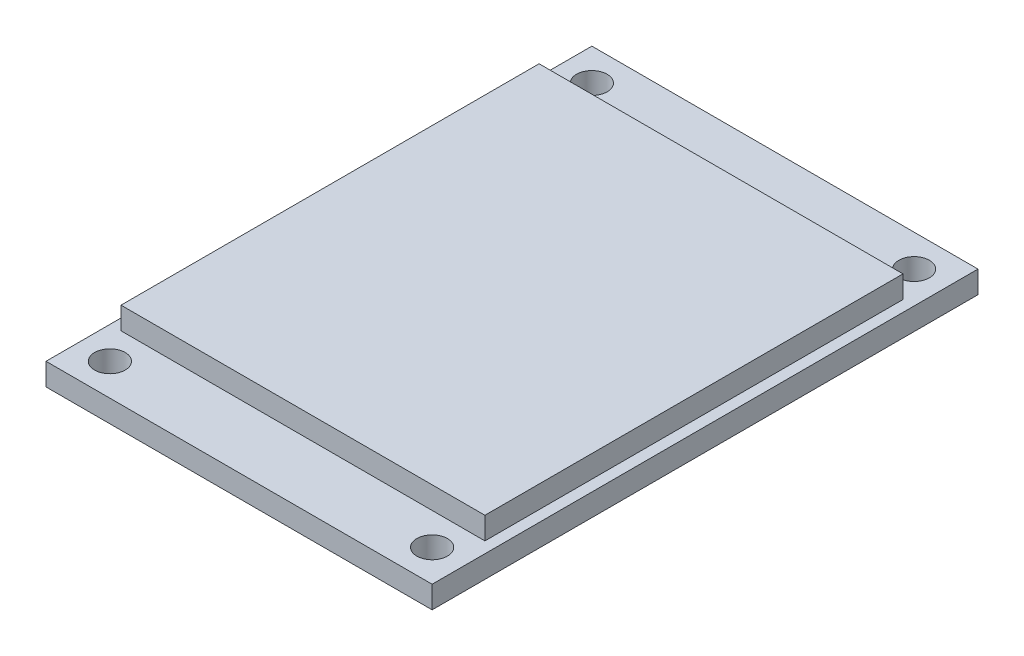
ISO-10303-21;
HEADER;
FILE_DESCRIPTION(('STEP AP214'),'2;1');
FILE_NAME('part.step','',(''),(''),'','','');
FILE_SCHEMA(('AUTOMOTIVE_DESIGN { 1 0 10303 214 1 1 1 1 }'));
ENDSEC;
DATA;
#1=APPLICATION_CONTEXT('core data for automotive mechanical design processes');
#2=APPLICATION_PROTOCOL_DEFINITION('international standard','automotive_design',2000,#1);
#3=PRODUCT_CONTEXT('',#1,'mechanical');
#4=PRODUCT('Part','Part','',(#3));
#5=PRODUCT_RELATED_PRODUCT_CATEGORY('part','',(#4));
#6=PRODUCT_DEFINITION_FORMATION('','',#4);
#7=PRODUCT_DEFINITION_CONTEXT('part definition',#1,'design');
#8=PRODUCT_DEFINITION('design','',#6,#7);
#9=PRODUCT_DEFINITION_SHAPE('','',#8);
#10=(LENGTH_UNIT() NAMED_UNIT(*) SI_UNIT(.MILLI.,.METRE.));
#11=(NAMED_UNIT(*) PLANE_ANGLE_UNIT() SI_UNIT($,.RADIAN.));
#12=(NAMED_UNIT(*) SI_UNIT($,.STERADIAN.) SOLID_ANGLE_UNIT());
#13=UNCERTAINTY_MEASURE_WITH_UNIT(LENGTH_MEASURE(1.E-05),#10,'distance_accuracy_value','');
#14=(GEOMETRIC_REPRESENTATION_CONTEXT(3) GLOBAL_UNCERTAINTY_ASSIGNED_CONTEXT((#13)) GLOBAL_UNIT_ASSIGNED_CONTEXT((#10,
#11,#12)) REPRESENTATION_CONTEXT('',''));
#15=CARTESIAN_POINT('',(0.,0.,0.));
#16=DIRECTION('',(0.,0.,1.));
#17=DIRECTION('',(1.,0.,0.));
#18=AXIS2_PLACEMENT_3D('',#15,#16,#17);
#19=CARTESIAN_POINT('',(0.,0.,0.));
#20=DIRECTION('',(0.,1.,0.));
#21=DIRECTION('',(0.,0.,1.));
#22=AXIS2_PLACEMENT_3D('',#19,#20,#21);
#23=PLANE('',#22);
#24=DIRECTION('',(0.,0.,1.));
#25=VECTOR('',#24,1.);
#26=CARTESIAN_POINT('',(-13.9,0.,19.65));
#27=LINE('',#26,#25);
#28=CARTESIAN_POINT('',(-13.9,0.,-19.65));
#29=VERTEX_POINT('',#28);
#30=CARTESIAN_POINT('',(-13.9,0.,19.65));
#31=VERTEX_POINT('',#30);
#32=EDGE_CURVE('E213',#29,#31,#27,.T.);
#33=ORIENTED_EDGE('',*,*,#32,.F.);
#34=DIRECTION('',(-1.,0.,0.));
#35=VECTOR('',#34,1.);
#36=CARTESIAN_POINT('',(13.9,0.,-19.65));
#37=LINE('',#36,#35);
#38=CARTESIAN_POINT('',(13.9,0.,-19.65));
#39=VERTEX_POINT('',#38);
#40=EDGE_CURVE('E220',#39,#29,#37,.T.);
#41=ORIENTED_EDGE('',*,*,#40,.F.);
#42=DIRECTION('',(0.,0.,-1.));
#43=VECTOR('',#42,1.);
#44=CARTESIAN_POINT('',(13.9,0.,19.65));
#45=LINE('',#44,#43);
#46=CARTESIAN_POINT('',(13.9,0.,19.65));
#47=VERTEX_POINT('',#46);
#48=EDGE_CURVE('E231',#47,#39,#45,.T.);
#49=ORIENTED_EDGE('',*,*,#48,.F.);
#50=DIRECTION('',(1.,0.,0.));
#51=VECTOR('',#50,1.);
#52=CARTESIAN_POINT('',(13.9,0.,19.65));
#53=LINE('',#52,#51);
#54=EDGE_CURVE('E229',#31,#47,#53,.T.);
#55=ORIENTED_EDGE('',*,*,#54,.F.);
#56=EDGE_LOOP('',(#33,#41,#49,#55));
#57=FACE_BOUND('',#56,.T.);
#58=CARTESIAN_POINT('',(-11.6,0.,-17.35));
#59=DIRECTION('',(0.,1.,0.));
#60=DIRECTION('',(0.,0.,1.));
#61=AXIS2_PLACEMENT_3D('',#58,#59,#60);
#62=CIRCLE('',#61,1.1);
#63=CARTESIAN_POINT('',(-11.6,0.,-16.25));
#64=VERTEX_POINT('',#63);
#65=EDGE_CURVE('E210',#64,#64,#62,.T.);
#66=ORIENTED_EDGE('',*,*,#65,.T.);
#67=EDGE_LOOP('',(#66));
#68=FACE_BOUND('',#67,.T.);
#69=CARTESIAN_POINT('',(11.6,0.,17.35));
#70=DIRECTION('',(0.,1.,0.));
#71=DIRECTION('',(0.,0.,1.));
#72=AXIS2_PLACEMENT_3D('',#69,#70,#71);
#73=CIRCLE('',#72,1.1);
#74=CARTESIAN_POINT('',(11.6,0.,18.45));
#75=VERTEX_POINT('',#74);
#76=EDGE_CURVE('E191',#75,#75,#73,.T.);
#77=ORIENTED_EDGE('',*,*,#76,.T.);
#78=EDGE_LOOP('',(#77));
#79=FACE_BOUND('',#78,.T.);
#80=CARTESIAN_POINT('',(-11.6,0.,17.35));
#81=DIRECTION('',(0.,1.,0.));
#82=DIRECTION('',(0.,0.,-1.));
#83=AXIS2_PLACEMENT_3D('',#80,#81,#82);
#84=CIRCLE('',#83,1.1);
#85=CARTESIAN_POINT('',(-11.6,0.,16.25));
#86=VERTEX_POINT('',#85);
#87=EDGE_CURVE('E195',#86,#86,#84,.T.);
#88=ORIENTED_EDGE('',*,*,#87,.T.);
#89=EDGE_LOOP('',(#88));
#90=FACE_BOUND('',#89,.T.);
#91=CARTESIAN_POINT('',(11.6,0.,-17.35));
#92=DIRECTION('',(0.,1.,0.));
#93=DIRECTION('',(0.,0.,-1.));
#94=AXIS2_PLACEMENT_3D('',#91,#92,#93);
#95=CIRCLE('',#94,1.1);
#96=CARTESIAN_POINT('',(11.6,0.,-18.45));
#97=VERTEX_POINT('',#96);
#98=EDGE_CURVE('E202',#97,#97,#95,.T.);
#99=ORIENTED_EDGE('',*,*,#98,.T.);
#100=EDGE_LOOP('',(#99));
#101=FACE_BOUND('',#100,.T.);
#102=DIRECTION('',(0.,0.,-1.));
#103=VECTOR('',#102,1.);
#104=CARTESIAN_POINT('',(-8.89,0.,-18.95));
#105=LINE('',#104,#103);
#106=CARTESIAN_POINT('',(-8.89,0.,-16.41));
#107=VERTEX_POINT('',#106);
#108=CARTESIAN_POINT('',(-8.89,0.,-18.95));
#109=VERTEX_POINT('',#108);
#110=EDGE_CURVE('E156',#107,#109,#105,.T.);
#111=ORIENTED_EDGE('',*,*,#110,.F.);
#112=DIRECTION('',(-1.,0.,0.));
#113=VECTOR('',#112,1.);
#114=CARTESIAN_POINT('',(8.89,0.,-16.41));
#115=LINE('',#114,#113);
#116=CARTESIAN_POINT('',(8.89,0.,-16.41));
#117=VERTEX_POINT('',#116);
#118=EDGE_CURVE('E153',#117,#107,#115,.T.);
#119=ORIENTED_EDGE('',*,*,#118,.F.);
#120=DIRECTION('',(0.,0.,1.));
#121=VECTOR('',#120,1.);
#122=CARTESIAN_POINT('',(8.89,0.,-18.95));
#123=LINE('',#122,#121);
#124=CARTESIAN_POINT('',(8.89,0.,-18.95));
#125=VERTEX_POINT('',#124);
#126=EDGE_CURVE('E67',#125,#117,#123,.T.);
#127=ORIENTED_EDGE('',*,*,#126,.F.);
#128=DIRECTION('',(1.,0.,0.));
#129=VECTOR('',#128,1.);
#130=CARTESIAN_POINT('',(8.89,0.,-18.95));
#131=LINE('',#130,#129);
#132=EDGE_CURVE('E62',#109,#125,#131,.T.);
#133=ORIENTED_EDGE('',*,*,#132,.F.);
#134=EDGE_LOOP('',(#111,#119,#127,#133));
#135=FACE_BOUND('',#134,.T.);
#136=ADVANCED_FACE('F47',(#57,#68,#79,#90,#101,#135),#23,.F.);
#137=CARTESIAN_POINT('',(0.,1.6,0.));
#138=DIRECTION('',(0.,1.,0.));
#139=DIRECTION('',(0.,0.,1.));
#140=AXIS2_PLACEMENT_3D('',#137,#138,#139);
#141=PLANE('',#140);
#142=CARTESIAN_POINT('',(11.6,1.6,-17.35));
#143=DIRECTION('',(0.,1.,0.));
#144=DIRECTION('',(0.,0.,-1.));
#145=AXIS2_PLACEMENT_3D('',#142,#143,#144);
#146=CIRCLE('',#145,1.1);
#147=CARTESIAN_POINT('',(11.6,1.6,-18.45));
#148=VERTEX_POINT('',#147);
#149=EDGE_CURVE('E198',#148,#148,#146,.T.);
#150=ORIENTED_EDGE('',*,*,#149,.F.);
#151=EDGE_LOOP('',(#150));
#152=FACE_BOUND('',#151,.T.);
#153=CARTESIAN_POINT('',(-11.6,1.6,17.35));
#154=DIRECTION('',(0.,1.,0.));
#155=DIRECTION('',(0.,0.,-1.));
#156=AXIS2_PLACEMENT_3D('',#153,#154,#155);
#157=CIRCLE('',#156,1.1);
#158=CARTESIAN_POINT('',(-11.6,1.6,16.25));
#159=VERTEX_POINT('',#158);
#160=EDGE_CURVE('E205',#159,#159,#157,.T.);
#161=ORIENTED_EDGE('',*,*,#160,.F.);
#162=EDGE_LOOP('',(#161));
#163=FACE_BOUND('',#162,.T.);
#164=CARTESIAN_POINT('',(11.6,1.6,17.35));
#165=DIRECTION('',(0.,1.,0.));
#166=DIRECTION('',(0.,0.,1.));
#167=AXIS2_PLACEMENT_3D('',#164,#165,#166);
#168=CIRCLE('',#167,1.1);
#169=CARTESIAN_POINT('',(11.6,1.6,18.45));
#170=VERTEX_POINT('',#169);
#171=EDGE_CURVE('E192',#170,#170,#168,.T.);
#172=ORIENTED_EDGE('',*,*,#171,.F.);
#173=EDGE_LOOP('',(#172));
#174=FACE_BOUND('',#173,.T.);
#175=CARTESIAN_POINT('',(-11.6,1.6,-17.35));
#176=DIRECTION('',(0.,1.,0.));
#177=DIRECTION('',(0.,0.,1.));
#178=AXIS2_PLACEMENT_3D('',#175,#176,#177);
#179=CIRCLE('',#178,1.1);
#180=CARTESIAN_POINT('',(-11.6,1.6,-16.25));
#181=VERTEX_POINT('',#180);
#182=EDGE_CURVE('E201',#181,#181,#179,.T.);
#183=ORIENTED_EDGE('',*,*,#182,.F.);
#184=EDGE_LOOP('',(#183));
#185=FACE_BOUND('',#184,.T.);
#186=DIRECTION('',(0.,0.,1.));
#187=VECTOR('',#186,1.);
#188=CARTESIAN_POINT('',(-13.9,1.6,19.65));
#189=LINE('',#188,#187);
#190=CARTESIAN_POINT('',(-13.9,1.6,-19.65));
#191=VERTEX_POINT('',#190);
#192=CARTESIAN_POINT('',(-13.9,1.6,19.65));
#193=VERTEX_POINT('',#192);
#194=EDGE_CURVE('E216',#191,#193,#189,.T.);
#195=ORIENTED_EDGE('',*,*,#194,.T.);
#196=DIRECTION('',(1.,0.,0.));
#197=VECTOR('',#196,1.);
#198=CARTESIAN_POINT('',(13.9,1.6,19.65));
#199=LINE('',#198,#197);
#200=CARTESIAN_POINT('',(13.9,1.6,19.65));
#201=VERTEX_POINT('',#200);
#202=EDGE_CURVE('E219',#193,#201,#199,.T.);
#203=ORIENTED_EDGE('',*,*,#202,.T.);
#204=DIRECTION('',(0.,0.,-1.));
#205=VECTOR('',#204,1.);
#206=CARTESIAN_POINT('',(13.9,1.6,19.65));
#207=LINE('',#206,#205);
#208=CARTESIAN_POINT('',(13.9,1.6,-19.65));
#209=VERTEX_POINT('',#208);
#210=EDGE_CURVE('E222',#201,#209,#207,.T.);
#211=ORIENTED_EDGE('',*,*,#210,.T.);
#212=DIRECTION('',(-1.,0.,0.));
#213=VECTOR('',#212,1.);
#214=CARTESIAN_POINT('',(13.9,1.6,-19.65));
#215=LINE('',#214,#213);
#216=EDGE_CURVE('E224',#209,#191,#215,.T.);
#217=ORIENTED_EDGE('',*,*,#216,.T.);
#218=EDGE_LOOP('',(#195,#203,#211,#217));
#219=FACE_BOUND('',#218,.T.);
#220=DIRECTION('',(-1.,0.,0.));
#221=VECTOR('',#220,1.);
#222=CARTESIAN_POINT('',(-13.1,1.6,-15.05));
#223=LINE('',#222,#221);
#224=CARTESIAN_POINT('',(13.1,1.6,-15.05));
#225=VERTEX_POINT('',#224);
#226=CARTESIAN_POINT('',(-13.1,1.6,-15.05));
#227=VERTEX_POINT('',#226);
#228=EDGE_CURVE('E160',#225,#227,#223,.T.);
#229=ORIENTED_EDGE('',*,*,#228,.F.);
#230=DIRECTION('',(0.,0.,-1.));
#231=VECTOR('',#230,1.);
#232=CARTESIAN_POINT('',(13.1,1.6,15.05));
#233=LINE('',#232,#231);
#234=CARTESIAN_POINT('',(13.1,1.6,15.05));
#235=VERTEX_POINT('',#234);
#236=EDGE_CURVE('E157',#235,#225,#233,.T.);
#237=ORIENTED_EDGE('',*,*,#236,.F.);
#238=DIRECTION('',(1.,0.,0.));
#239=VECTOR('',#238,1.);
#240=CARTESIAN_POINT('',(-13.1,1.6,15.05));
#241=LINE('',#240,#239);
#242=CARTESIAN_POINT('',(-13.1,1.6,15.05));
#243=VERTEX_POINT('',#242);
#244=EDGE_CURVE('E170',#243,#235,#241,.T.);
#245=ORIENTED_EDGE('',*,*,#244,.F.);
#246=DIRECTION('',(0.,0.,1.));
#247=VECTOR('',#246,1.);
#248=CARTESIAN_POINT('',(-13.1,1.6,15.05));
#249=LINE('',#248,#247);
#250=EDGE_CURVE('E178',#227,#243,#249,.T.);
#251=ORIENTED_EDGE('',*,*,#250,.F.);
#252=EDGE_LOOP('',(#229,#237,#245,#251));
#253=FACE_BOUND('',#252,.T.);
#254=ADVANCED_FACE('F258',(#152,#163,#174,#185,#219,#253),#141,.T.);
#255=CARTESIAN_POINT('',(-13.9,1.6,19.65));
#256=DIRECTION('',(1.,0.,0.));
#257=DIRECTION('',(0.,0.,-1.));
#258=AXIS2_PLACEMENT_3D('',#255,#256,#257);
#259=PLANE('',#258);
#260=ORIENTED_EDGE('',*,*,#32,.T.);
#261=DIRECTION('',(0.,-1.,0.));
#262=VECTOR('',#261,1.);
#263=CARTESIAN_POINT('',(-13.9,1.6,19.65));
#264=LINE('',#263,#262);
#265=EDGE_CURVE('E11',#193,#31,#264,.T.);
#266=ORIENTED_EDGE('',*,*,#265,.F.);
#267=ORIENTED_EDGE('',*,*,#194,.F.);
#268=DIRECTION('',(0.,-1.,0.));
#269=VECTOR('',#268,1.);
#270=CARTESIAN_POINT('',(-13.9,1.6,-19.65));
#271=LINE('',#270,#269);
#272=EDGE_CURVE('E226',#191,#29,#271,.T.);
#273=ORIENTED_EDGE('',*,*,#272,.T.);
#274=EDGE_LOOP('',(#260,#266,#267,#273));
#275=FACE_BOUND('',#274,.T.);
#276=ADVANCED_FACE('F49',(#275),#259,.F.);
#277=CARTESIAN_POINT('',(13.9,1.6,19.65));
#278=DIRECTION('',(0.,0.,-1.));
#279=DIRECTION('',(-1.,0.,0.));
#280=AXIS2_PLACEMENT_3D('',#277,#278,#279);
#281=PLANE('',#280);
#282=ORIENTED_EDGE('',*,*,#54,.T.);
#283=DIRECTION('',(0.,-1.,0.));
#284=VECTOR('',#283,1.);
#285=CARTESIAN_POINT('',(13.9,1.6,19.65));
#286=LINE('',#285,#284);
#287=EDGE_CURVE('E55',#201,#47,#286,.T.);
#288=ORIENTED_EDGE('',*,*,#287,.F.);
#289=ORIENTED_EDGE('',*,*,#202,.F.);
#290=ORIENTED_EDGE('',*,*,#265,.T.);
#291=EDGE_LOOP('',(#282,#288,#289,#290));
#292=FACE_BOUND('',#291,.T.);
#293=ADVANCED_FACE('F260',(#292),#281,.F.);
#294=CARTESIAN_POINT('',(13.9,1.6,19.65));
#295=DIRECTION('',(-1.,0.,0.));
#296=DIRECTION('',(0.,0.,1.));
#297=AXIS2_PLACEMENT_3D('',#294,#295,#296);
#298=PLANE('',#297);
#299=ORIENTED_EDGE('',*,*,#48,.T.);
#300=DIRECTION('',(0.,-1.,0.));
#301=VECTOR('',#300,1.);
#302=CARTESIAN_POINT('',(13.9,1.6,-19.65));
#303=LINE('',#302,#301);
#304=EDGE_CURVE('E236',#209,#39,#303,.T.);
#305=ORIENTED_EDGE('',*,*,#304,.F.);
#306=ORIENTED_EDGE('',*,*,#210,.F.);
#307=ORIENTED_EDGE('',*,*,#287,.T.);
#308=EDGE_LOOP('',(#299,#305,#306,#307));
#309=FACE_BOUND('',#308,.T.);
#310=ADVANCED_FACE('F243',(#309),#298,.F.);
#311=CARTESIAN_POINT('',(13.9,1.6,-19.65));
#312=DIRECTION('',(0.,0.,1.));
#313=DIRECTION('',(1.,0.,0.));
#314=AXIS2_PLACEMENT_3D('',#311,#312,#313);
#315=PLANE('',#314);
#316=ORIENTED_EDGE('',*,*,#40,.T.);
#317=ORIENTED_EDGE('',*,*,#272,.F.);
#318=ORIENTED_EDGE('',*,*,#216,.F.);
#319=ORIENTED_EDGE('',*,*,#304,.T.);
#320=EDGE_LOOP('',(#316,#317,#318,#319));
#321=FACE_BOUND('',#320,.T.);
#322=ADVANCED_FACE('F252',(#321),#315,.F.);
#323=CARTESIAN_POINT('',(-11.6,0.,-17.35));
#324=DIRECTION('',(0.,1.,0.));
#325=DIRECTION('',(0.,0.,1.));
#326=AXIS2_PLACEMENT_3D('',#323,#324,#325);
#327=CYLINDRICAL_SURFACE('',#326,1.1);
#328=ORIENTED_EDGE('',*,*,#65,.F.);
#329=EDGE_LOOP('',(#328));
#330=FACE_BOUND('',#329,.T.);
#331=ORIENTED_EDGE('',*,*,#182,.T.);
#332=EDGE_LOOP('',(#331));
#333=FACE_BOUND('',#332,.T.);
#334=ADVANCED_FACE('F279',(#330,#333),#327,.F.);
#335=CARTESIAN_POINT('',(11.6,0.,17.35));
#336=DIRECTION('',(0.,1.,0.));
#337=DIRECTION('',(0.,0.,1.));
#338=AXIS2_PLACEMENT_3D('',#335,#336,#337);
#339=CYLINDRICAL_SURFACE('',#338,1.1);
#340=ORIENTED_EDGE('',*,*,#76,.F.);
#341=EDGE_LOOP('',(#340));
#342=FACE_BOUND('',#341,.T.);
#343=ORIENTED_EDGE('',*,*,#171,.T.);
#344=EDGE_LOOP('',(#343));
#345=FACE_BOUND('',#344,.T.);
#346=ADVANCED_FACE('F283',(#342,#345),#339,.F.);
#347=CARTESIAN_POINT('',(-11.6,0.,17.35));
#348=DIRECTION('',(0.,1.,0.));
#349=DIRECTION('',(0.,0.,1.));
#350=AXIS2_PLACEMENT_3D('',#347,#348,#349);
#351=CYLINDRICAL_SURFACE('',#350,1.1);
#352=ORIENTED_EDGE('',*,*,#87,.F.);
#353=EDGE_LOOP('',(#352));
#354=FACE_BOUND('',#353,.T.);
#355=ORIENTED_EDGE('',*,*,#160,.T.);
#356=EDGE_LOOP('',(#355));
#357=FACE_BOUND('',#356,.T.);
#358=ADVANCED_FACE('F288',(#354,#357),#351,.F.);
#359=CARTESIAN_POINT('',(11.6,0.,-17.35));
#360=DIRECTION('',(0.,1.,0.));
#361=DIRECTION('',(0.,0.,1.));
#362=AXIS2_PLACEMENT_3D('',#359,#360,#361);
#363=CYLINDRICAL_SURFACE('',#362,1.1);
#364=ORIENTED_EDGE('',*,*,#98,.F.);
#365=EDGE_LOOP('',(#364));
#366=FACE_BOUND('',#365,.T.);
#367=ORIENTED_EDGE('',*,*,#149,.T.);
#368=EDGE_LOOP('',(#367));
#369=FACE_BOUND('',#368,.T.);
#370=ADVANCED_FACE('F296',(#366,#369),#363,.F.);
#371=CARTESIAN_POINT('',(13.1,3.2,15.05));
#372=DIRECTION('',(-1.,0.,0.));
#373=DIRECTION('',(0.,0.,1.));
#374=AXIS2_PLACEMENT_3D('',#371,#372,#373);
#375=PLANE('',#374);
#376=ORIENTED_EDGE('',*,*,#236,.T.);
#377=DIRECTION('',(0.,-1.,0.));
#378=VECTOR('',#377,1.);
#379=CARTESIAN_POINT('',(13.1,3.2,-15.05));
#380=LINE('',#379,#378);
#381=CARTESIAN_POINT('',(13.1,3.2,-15.05));
#382=VERTEX_POINT('',#381);
#383=EDGE_CURVE('E189',#382,#225,#380,.T.);
#384=ORIENTED_EDGE('',*,*,#383,.F.);
#385=DIRECTION('',(0.,0.,-1.));
#386=VECTOR('',#385,1.);
#387=CARTESIAN_POINT('',(13.1,3.2,15.05));
#388=LINE('',#387,#386);
#389=CARTESIAN_POINT('',(13.1,3.2,15.05));
#390=VERTEX_POINT('',#389);
#391=EDGE_CURVE('E166',#390,#382,#388,.T.);
#392=ORIENTED_EDGE('',*,*,#391,.F.);
#393=DIRECTION('',(0.,-1.,0.));
#394=VECTOR('',#393,1.);
#395=CARTESIAN_POINT('',(13.1,3.2,15.05));
#396=LINE('',#395,#394);
#397=EDGE_CURVE('E175',#390,#235,#396,.T.);
#398=ORIENTED_EDGE('',*,*,#397,.T.);
#399=EDGE_LOOP('',(#376,#384,#392,#398));
#400=FACE_BOUND('',#399,.T.);
#401=ADVANCED_FACE('F299',(#400),#375,.F.);
#402=CARTESIAN_POINT('',(-13.1,3.2,-15.05));
#403=DIRECTION('',(0.,0.,1.));
#404=DIRECTION('',(1.,0.,0.));
#405=AXIS2_PLACEMENT_3D('',#402,#403,#404);
#406=PLANE('',#405);
#407=ORIENTED_EDGE('',*,*,#228,.T.);
#408=DIRECTION('',(0.,-1.,0.));
#409=VECTOR('',#408,1.);
#410=CARTESIAN_POINT('',(-13.1,3.2,-15.05));
#411=LINE('',#410,#409);
#412=CARTESIAN_POINT('',(-13.1,3.2,-15.05));
#413=VERTEX_POINT('',#412);
#414=EDGE_CURVE('E186',#413,#227,#411,.T.);
#415=ORIENTED_EDGE('',*,*,#414,.F.);
#416=DIRECTION('',(-1.,0.,0.));
#417=VECTOR('',#416,1.);
#418=CARTESIAN_POINT('',(-13.1,3.2,-15.05));
#419=LINE('',#418,#417);
#420=EDGE_CURVE('E169',#382,#413,#419,.T.);
#421=ORIENTED_EDGE('',*,*,#420,.F.);
#422=ORIENTED_EDGE('',*,*,#383,.T.);
#423=EDGE_LOOP('',(#407,#415,#421,#422));
#424=FACE_BOUND('',#423,.T.);
#425=ADVANCED_FACE('F304',(#424),#406,.F.);
#426=CARTESIAN_POINT('',(-13.1,3.2,15.05));
#427=DIRECTION('',(1.,0.,0.));
#428=DIRECTION('',(0.,0.,-1.));
#429=AXIS2_PLACEMENT_3D('',#426,#427,#428);
#430=PLANE('',#429);
#431=ORIENTED_EDGE('',*,*,#250,.T.);
#432=DIRECTION('',(0.,-1.,0.));
#433=VECTOR('',#432,1.);
#434=CARTESIAN_POINT('',(-13.1,3.2,15.05));
#435=LINE('',#434,#433);
#436=CARTESIAN_POINT('',(-13.1,3.2,15.05));
#437=VERTEX_POINT('',#436);
#438=EDGE_CURVE('E184',#437,#243,#435,.T.);
#439=ORIENTED_EDGE('',*,*,#438,.F.);
#440=DIRECTION('',(0.,0.,1.));
#441=VECTOR('',#440,1.);
#442=CARTESIAN_POINT('',(-13.1,3.2,15.05));
#443=LINE('',#442,#441);
#444=EDGE_CURVE('E172',#413,#437,#443,.T.);
#445=ORIENTED_EDGE('',*,*,#444,.F.);
#446=ORIENTED_EDGE('',*,*,#414,.T.);
#447=EDGE_LOOP('',(#431,#439,#445,#446));
#448=FACE_BOUND('',#447,.T.);
#449=ADVANCED_FACE('F308',(#448),#430,.F.);
#450=CARTESIAN_POINT('',(-13.1,3.2,15.05));
#451=DIRECTION('',(0.,0.,-1.));
#452=DIRECTION('',(-1.,0.,0.));
#453=AXIS2_PLACEMENT_3D('',#450,#451,#452);
#454=PLANE('',#453);
#455=ORIENTED_EDGE('',*,*,#244,.T.);
#456=ORIENTED_EDGE('',*,*,#397,.F.);
#457=DIRECTION('',(1.,0.,0.));
#458=VECTOR('',#457,1.);
#459=CARTESIAN_POINT('',(-13.1,3.2,15.05));
#460=LINE('',#459,#458);
#461=EDGE_CURVE('E174',#437,#390,#460,.T.);
#462=ORIENTED_EDGE('',*,*,#461,.F.);
#463=ORIENTED_EDGE('',*,*,#438,.T.);
#464=EDGE_LOOP('',(#455,#456,#462,#463));
#465=FACE_BOUND('',#464,.T.);
#466=ADVANCED_FACE('F312',(#465),#454,.F.);
#467=CARTESIAN_POINT('',(0.,3.2,0.));
#468=DIRECTION('',(0.,-1.,0.));
#469=DIRECTION('',(0.,0.,-1.));
#470=AXIS2_PLACEMENT_3D('',#467,#468,#469);
#471=PLANE('',#470);
#472=ORIENTED_EDGE('',*,*,#391,.T.);
#473=ORIENTED_EDGE('',*,*,#420,.T.);
#474=ORIENTED_EDGE('',*,*,#444,.T.);
#475=ORIENTED_EDGE('',*,*,#461,.T.);
#476=EDGE_LOOP('',(#472,#473,#474,#475));
#477=FACE_BOUND('',#476,.T.);
#478=ADVANCED_FACE('F316',(#477),#471,.F.);
#479=CARTESIAN_POINT('',(-8.89,-2.54,-18.95));
#480=DIRECTION('',(1.,0.,0.));
#481=DIRECTION('',(0.,0.,-1.));
#482=AXIS2_PLACEMENT_3D('',#479,#480,#481);
#483=PLANE('',#482);
#484=ORIENTED_EDGE('',*,*,#110,.T.);
#485=DIRECTION('',(0.,1.,0.));
#486=VECTOR('',#485,1.);
#487=CARTESIAN_POINT('',(-8.89,-2.54,-18.95));
#488=LINE('',#487,#486);
#489=CARTESIAN_POINT('',(-8.89,-2.54,-18.95));
#490=VERTEX_POINT('',#489);
#491=EDGE_CURVE('E137',#490,#109,#488,.T.);
#492=ORIENTED_EDGE('',*,*,#491,.F.);
#493=DIRECTION('',(0.,0.,-1.));
#494=VECTOR('',#493,1.);
#495=CARTESIAN_POINT('',(-8.89,-2.54,-18.95));
#496=LINE('',#495,#494);
#497=CARTESIAN_POINT('',(-8.89,-2.54,-16.41));
#498=VERTEX_POINT('',#497);
#499=EDGE_CURVE('E144',#498,#490,#496,.T.);
#500=ORIENTED_EDGE('',*,*,#499,.F.);
#501=DIRECTION('',(0.,1.,0.));
#502=VECTOR('',#501,1.);
#503=CARTESIAN_POINT('',(-8.89,-2.54,-16.41));
#504=LINE('',#503,#502);
#505=EDGE_CURVE('E458',#498,#107,#504,.T.);
#506=ORIENTED_EDGE('',*,*,#505,.T.);
#507=EDGE_LOOP('',(#484,#492,#500,#506));
#508=FACE_BOUND('',#507,.T.);
#509=ADVANCED_FACE('F155',(#508),#483,.F.);
#510=CARTESIAN_POINT('',(8.89,-2.54,-18.95));
#511=DIRECTION('',(0.,0.,1.));
#512=DIRECTION('',(1.,0.,0.));
#513=AXIS2_PLACEMENT_3D('',#510,#511,#512);
#514=PLANE('',#513);
#515=ORIENTED_EDGE('',*,*,#132,.T.);
#516=DIRECTION('',(0.,1.,0.));
#517=VECTOR('',#516,1.);
#518=CARTESIAN_POINT('',(8.89,-2.54,-18.95));
#519=LINE('',#518,#517);
#520=CARTESIAN_POINT('',(8.89,-2.54,-18.95));
#521=VERTEX_POINT('',#520);
#522=EDGE_CURVE('E140',#521,#125,#519,.T.);
#523=ORIENTED_EDGE('',*,*,#522,.F.);
#524=DIRECTION('',(1.,0.,0.));
#525=VECTOR('',#524,1.);
#526=CARTESIAN_POINT('',(8.89,-2.54,-18.95));
#527=LINE('',#526,#525);
#528=EDGE_CURVE('E133',#490,#521,#527,.T.);
#529=ORIENTED_EDGE('',*,*,#528,.F.);
#530=ORIENTED_EDGE('',*,*,#491,.T.);
#531=EDGE_LOOP('',(#515,#523,#529,#530));
#532=FACE_BOUND('',#531,.T.);
#533=ADVANCED_FACE('F135',(#532),#514,.F.);
#534=CARTESIAN_POINT('',(8.89,-2.54,-18.95));
#535=DIRECTION('',(-1.,0.,0.));
#536=DIRECTION('',(0.,0.,1.));
#537=AXIS2_PLACEMENT_3D('',#534,#535,#536);
#538=PLANE('',#537);
#539=ORIENTED_EDGE('',*,*,#126,.T.);
#540=DIRECTION('',(0.,1.,0.));
#541=VECTOR('',#540,1.);
#542=CARTESIAN_POINT('',(8.89,-2.54,-16.41));
#543=LINE('',#542,#541);
#544=CARTESIAN_POINT('',(8.89,-2.54,-16.41));
#545=VERTEX_POINT('',#544);
#546=EDGE_CURVE('E162',#545,#117,#543,.T.);
#547=ORIENTED_EDGE('',*,*,#546,.F.);
#548=DIRECTION('',(0.,0.,1.));
#549=VECTOR('',#548,1.);
#550=CARTESIAN_POINT('',(8.89,-2.54,-18.95));
#551=LINE('',#550,#549);
#552=EDGE_CURVE('E143',#521,#545,#551,.T.);
#553=ORIENTED_EDGE('',*,*,#552,.F.);
#554=ORIENTED_EDGE('',*,*,#522,.T.);
#555=EDGE_LOOP('',(#539,#547,#553,#554));
#556=FACE_BOUND('',#555,.T.);
#557=ADVANCED_FACE('F324',(#556),#538,.F.);
#558=CARTESIAN_POINT('',(8.89,-2.54,-16.41));
#559=DIRECTION('',(0.,0.,-1.));
#560=DIRECTION('',(-1.,0.,0.));
#561=AXIS2_PLACEMENT_3D('',#558,#559,#560);
#562=PLANE('',#561);
#563=ORIENTED_EDGE('',*,*,#118,.T.);
#564=ORIENTED_EDGE('',*,*,#505,.F.);
#565=DIRECTION('',(-1.,0.,0.));
#566=VECTOR('',#565,1.);
#567=CARTESIAN_POINT('',(8.89,-2.54,-16.41));
#568=LINE('',#567,#566);
#569=EDGE_CURVE('E149',#545,#498,#568,.T.);
#570=ORIENTED_EDGE('',*,*,#569,.F.);
#571=ORIENTED_EDGE('',*,*,#546,.T.);
#572=EDGE_LOOP('',(#563,#564,#570,#571));
#573=FACE_BOUND('',#572,.T.);
#574=ADVANCED_FACE('F327',(#573),#562,.F.);
#575=CARTESIAN_POINT('',(0.,-2.54,0.));
#576=DIRECTION('',(0.,-1.,0.));
#577=DIRECTION('',(0.,0.,-1.));
#578=AXIS2_PLACEMENT_3D('',#575,#576,#577);
#579=PLANE('',#578);
#580=ORIENTED_EDGE('',*,*,#499,.T.);
#581=ORIENTED_EDGE('',*,*,#528,.T.);
#582=ORIENTED_EDGE('',*,*,#552,.T.);
#583=ORIENTED_EDGE('',*,*,#569,.T.);
#584=EDGE_LOOP('',(#580,#581,#582,#583));
#585=FACE_BOUND('',#584,.T.);
#586=ADVANCED_FACE('F147',(#585),#579,.T.);
#587=CLOSED_SHELL('',(#136,#254,#276,#293,#310,#322,#334,#346,#358,#370,#401,#425,#449,#466,
#478,#509,#533,#557,#574,#586));
#588=MANIFOLD_SOLID_BREP('B2',#587);
#589=ADVANCED_BREP_SHAPE_REPRESENTATION('',(#18,#588),#14);
#590=SHAPE_DEFINITION_REPRESENTATION(#9,#589);
ENDSEC;
END-ISO-10303-21;
